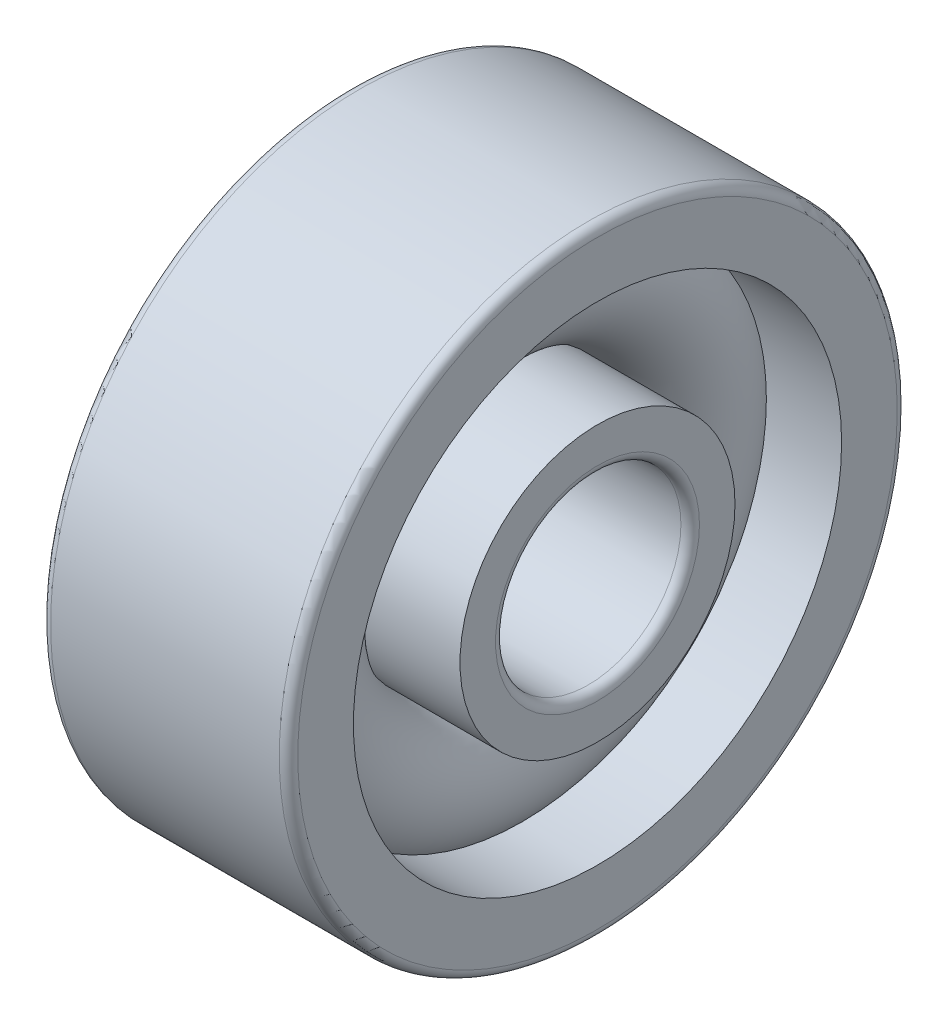
ISO-10303-21;
HEADER;
FILE_DESCRIPTION(('STEP AP214'),'2;1');
FILE_NAME('part.step','',(''),(''),'','','');
FILE_SCHEMA(('AUTOMOTIVE_DESIGN { 1 0 10303 214 1 1 1 1 }'));
ENDSEC;
DATA;
#1=APPLICATION_CONTEXT('core data for automotive mechanical design processes');
#2=APPLICATION_PROTOCOL_DEFINITION('international standard','automotive_design',2000,#1);
#3=PRODUCT_CONTEXT('',#1,'mechanical');
#4=PRODUCT('Part','Part','',(#3));
#5=PRODUCT_RELATED_PRODUCT_CATEGORY('part','',(#4));
#6=PRODUCT_DEFINITION_FORMATION('','',#4);
#7=PRODUCT_DEFINITION_CONTEXT('part definition',#1,'design');
#8=PRODUCT_DEFINITION('design','',#6,#7);
#9=PRODUCT_DEFINITION_SHAPE('','',#8);
#10=(LENGTH_UNIT() NAMED_UNIT(*) SI_UNIT(.MILLI.,.METRE.));
#11=(NAMED_UNIT(*) PLANE_ANGLE_UNIT() SI_UNIT($,.RADIAN.));
#12=(NAMED_UNIT(*) SI_UNIT($,.STERADIAN.) SOLID_ANGLE_UNIT());
#13=UNCERTAINTY_MEASURE_WITH_UNIT(LENGTH_MEASURE(1.E-05),#10,'distance_accuracy_value','');
#14=(GEOMETRIC_REPRESENTATION_CONTEXT(3) GLOBAL_UNCERTAINTY_ASSIGNED_CONTEXT((#13)) GLOBAL_UNIT_ASSIGNED_CONTEXT((#10,
#11,#12)) REPRESENTATION_CONTEXT('',''));
#15=CARTESIAN_POINT('',(0.,0.,0.));
#16=DIRECTION('',(0.,0.,1.));
#17=DIRECTION('',(1.,0.,0.));
#18=AXIS2_PLACEMENT_3D('',#15,#16,#17);
#19=CARTESIAN_POINT('',(0.,0.,0.));
#20=DIRECTION('',(-1.,0.,0.));
#21=DIRECTION('',(0.,0.,1.));
#22=AXIS2_PLACEMENT_3D('',#19,#20,#21);
#23=TOROIDAL_SURFACE('',#22,3.25,1.05);
#24=CARTESIAN_POINT('',(0.782623792124926,0.,0.));
#25=DIRECTION('',(-1.,0.,0.));
#26=DIRECTION('',(0.,0.,1.));
#27=AXIS2_PLACEMENT_3D('',#24,#25,#26);
#28=CIRCLE('',#27,3.95);
#29=CARTESIAN_POINT('',(0.782623792124926,0.,3.95));
#30=VERTEX_POINT('',#29);
#31=EDGE_CURVE('E45',#30,#30,#28,.F.);
#32=ORIENTED_EDGE('',*,*,#31,.T.);
#33=EDGE_LOOP('',(#32));
#34=FACE_BOUND('',#33,.T.);
#35=CARTESIAN_POINT('',(0.227760839478607,0.,0.));
#36=DIRECTION('',(-1.,0.,0.));
#37=DIRECTION('',(0.,0.,1.));
#38=AXIS2_PLACEMENT_3D('',#35,#36,#37);
#39=CIRCLE('',#38,2.225);
#40=CARTESIAN_POINT('',(0.227760839478607,0.,2.225));
#41=VERTEX_POINT('',#40);
#42=EDGE_CURVE('E10',#41,#41,#39,.T.);
#43=ORIENTED_EDGE('',*,*,#42,.T.);
#44=EDGE_LOOP('',(#43));
#45=FACE_BOUND('',#44,.T.);
#46=ADVANCED_FACE('F41',(#34,#45),#23,.T.);
#47=CARTESIAN_POINT('',(-20.6375,0.,0.));
#48=DIRECTION('',(1.,0.,0.));
#49=DIRECTION('',(0.,0.,-1.));
#50=AXIS2_PLACEMENT_3D('',#47,#48,#49);
#51=CYLINDRICAL_SURFACE('',#50,2.225);
#52=CARTESIAN_POINT('',(2.,0.,0.));
#53=DIRECTION('',(1.,0.,0.));
#54=DIRECTION('',(0.,0.,-1.));
#55=AXIS2_PLACEMENT_3D('',#52,#53,#54);
#56=CIRCLE('',#55,2.225);
#57=CARTESIAN_POINT('',(2.,0.,-2.225));
#58=VERTEX_POINT('',#57);
#59=EDGE_CURVE('E56',#58,#58,#56,.T.);
#60=ORIENTED_EDGE('',*,*,#59,.F.);
#61=EDGE_LOOP('',(#60));
#62=FACE_BOUND('',#61,.T.);
#63=ORIENTED_EDGE('',*,*,#42,.F.);
#64=EDGE_LOOP('',(#63));
#65=FACE_BOUND('',#64,.T.);
#66=ADVANCED_FACE('F105',(#62,#65),#51,.T.);
#67=CARTESIAN_POINT('',(-20.6375,0.,0.));
#68=DIRECTION('',(1.,0.,0.));
#69=DIRECTION('',(0.,0.,-1.));
#70=AXIS2_PLACEMENT_3D('',#67,#68,#69);
#71=CYLINDRICAL_SURFACE('',#70,2.55);
#72=CARTESIAN_POINT('',(-2.,0.,0.));
#73=DIRECTION('',(1.,0.,0.));
#74=DIRECTION('',(0.,0.,-1.));
#75=AXIS2_PLACEMENT_3D('',#72,#73,#74);
#76=CIRCLE('',#75,2.55);
#77=CARTESIAN_POINT('',(-2.,0.,-2.55));
#78=VERTEX_POINT('',#77);
#79=EDGE_CURVE('E68',#78,#78,#76,.T.);
#80=ORIENTED_EDGE('',*,*,#79,.T.);
#81=EDGE_LOOP('',(#80));
#82=FACE_BOUND('',#81,.T.);
#83=CARTESIAN_POINT('',(-0.782623792124926,0.,0.));
#84=DIRECTION('',(1.,0.,0.));
#85=DIRECTION('',(0.,0.,-1.));
#86=AXIS2_PLACEMENT_3D('',#83,#84,#85);
#87=CIRCLE('',#86,2.55);
#88=CARTESIAN_POINT('',(-0.782623792124926,0.,-2.55));
#89=VERTEX_POINT('',#88);
#90=EDGE_CURVE('E50',#89,#89,#87,.T.);
#91=ORIENTED_EDGE('',*,*,#90,.F.);
#92=EDGE_LOOP('',(#91));
#93=FACE_BOUND('',#92,.T.);
#94=ADVANCED_FACE('F108',(#82,#93),#71,.T.);
#95=CARTESIAN_POINT('',(2.,1.65,0.));
#96=DIRECTION('',(1.,0.,0.));
#97=DIRECTION('',(0.,0.,-1.));
#98=AXIS2_PLACEMENT_3D('',#95,#96,#97);
#99=PLANE('',#98);
#100=ORIENTED_EDGE('',*,*,#59,.T.);
#101=EDGE_LOOP('',(#100));
#102=FACE_BOUND('',#101,.T.);
#103=CARTESIAN_POINT('',(2.,0.,0.));
#104=DIRECTION('',(1.,0.,0.));
#105=DIRECTION('',(0.,0.,-1.));
#106=AXIS2_PLACEMENT_3D('',#103,#104,#105);
#107=CIRCLE('',#106,1.65);
#108=CARTESIAN_POINT('',(2.,0.,-1.65));
#109=VERTEX_POINT('',#108);
#110=EDGE_CURVE('E95',#109,#109,#107,.T.);
#111=ORIENTED_EDGE('',*,*,#110,.F.);
#112=EDGE_LOOP('',(#111));
#113=FACE_BOUND('',#112,.T.);
#114=ADVANCED_FACE('F102',(#102,#113),#99,.T.);
#115=CARTESIAN_POINT('',(1.85,0.,0.));
#116=DIRECTION('',(1.,0.,0.));
#117=DIRECTION('',(0.,0.,-1.));
#118=AXIS2_PLACEMENT_3D('',#115,#116,#117);
#119=TOROIDAL_SURFACE('',#118,1.65,0.15);
#120=ORIENTED_EDGE('',*,*,#110,.T.);
#121=EDGE_LOOP('',(#120));
#122=FACE_BOUND('',#121,.T.);
#123=CARTESIAN_POINT('',(1.85,0.,0.));
#124=DIRECTION('',(1.,0.,0.));
#125=DIRECTION('',(0.,0.,-1.));
#126=AXIS2_PLACEMENT_3D('',#123,#124,#125);
#127=CIRCLE('',#126,1.5);
#128=CARTESIAN_POINT('',(1.85,0.,-1.5));
#129=VERTEX_POINT('',#128);
#130=EDGE_CURVE('E91',#129,#129,#127,.T.);
#131=ORIENTED_EDGE('',*,*,#130,.F.);
#132=EDGE_LOOP('',(#131));
#133=FACE_BOUND('',#132,.T.);
#134=ADVANCED_FACE('F119',(#122,#133),#119,.T.);
#135=CARTESIAN_POINT('',(-20.6375,0.,0.));
#136=DIRECTION('',(1.,0.,0.));
#137=DIRECTION('',(0.,0.,-1.));
#138=AXIS2_PLACEMENT_3D('',#135,#136,#137);
#139=CYLINDRICAL_SURFACE('',#138,1.5);
#140=ORIENTED_EDGE('',*,*,#130,.T.);
#141=EDGE_LOOP('',(#140));
#142=FACE_BOUND('',#141,.T.);
#143=CARTESIAN_POINT('',(-1.85,0.,0.));
#144=DIRECTION('',(1.,0.,0.));
#145=DIRECTION('',(0.,0.,-1.));
#146=AXIS2_PLACEMENT_3D('',#143,#144,#145);
#147=CIRCLE('',#146,1.5);
#148=CARTESIAN_POINT('',(-1.85,0.,-1.5));
#149=VERTEX_POINT('',#148);
#150=EDGE_CURVE('E87',#149,#149,#147,.T.);
#151=ORIENTED_EDGE('',*,*,#150,.F.);
#152=EDGE_LOOP('',(#151));
#153=FACE_BOUND('',#152,.T.);
#154=ADVANCED_FACE('F122',(#142,#153),#139,.F.);
#155=CARTESIAN_POINT('',(-1.85,0.,0.));
#156=DIRECTION('',(1.,0.,0.));
#157=DIRECTION('',(0.,0.,-1.));
#158=AXIS2_PLACEMENT_3D('',#155,#156,#157);
#159=TOROIDAL_SURFACE('',#158,1.65,0.15);
#160=ORIENTED_EDGE('',*,*,#150,.T.);
#161=EDGE_LOOP('',(#160));
#162=FACE_BOUND('',#161,.T.);
#163=CARTESIAN_POINT('',(-2.,0.,0.));
#164=DIRECTION('',(1.,0.,0.));
#165=DIRECTION('',(0.,0.,-1.));
#166=AXIS2_PLACEMENT_3D('',#163,#164,#165);
#167=CIRCLE('',#166,1.65);
#168=CARTESIAN_POINT('',(-2.,0.,-1.65));
#169=VERTEX_POINT('',#168);
#170=EDGE_CURVE('E83',#169,#169,#167,.T.);
#171=ORIENTED_EDGE('',*,*,#170,.F.);
#172=EDGE_LOOP('',(#171));
#173=FACE_BOUND('',#172,.T.);
#174=ADVANCED_FACE('F126',(#162,#173),#159,.T.);
#175=CARTESIAN_POINT('',(-2.,2.55,0.));
#176=DIRECTION('',(-1.,0.,0.));
#177=DIRECTION('',(0.,0.,1.));
#178=AXIS2_PLACEMENT_3D('',#175,#176,#177);
#179=PLANE('',#178);
#180=ORIENTED_EDGE('',*,*,#170,.T.);
#181=EDGE_LOOP('',(#180));
#182=FACE_BOUND('',#181,.T.);
#183=ORIENTED_EDGE('',*,*,#79,.F.);
#184=EDGE_LOOP('',(#183));
#185=FACE_BOUND('',#184,.T.);
#186=ADVANCED_FACE('F130',(#182,#185),#179,.T.);
#187=CARTESIAN_POINT('',(-0.227760839478607,0.,0.));
#188=DIRECTION('',(1.,0.,0.));
#189=DIRECTION('',(0.,0.,-1.));
#190=AXIS2_PLACEMENT_3D('',#187,#188,#189);
#191=CIRCLE('',#190,4.275);
#192=CARTESIAN_POINT('',(-0.227760839478607,0.,-4.275));
#193=VERTEX_POINT('',#192);
#194=EDGE_CURVE('E59',#193,#193,#191,.F.);
#195=ORIENTED_EDGE('',*,*,#194,.T.);
#196=EDGE_LOOP('',(#195));
#197=FACE_BOUND('',#196,.T.);
#198=ORIENTED_EDGE('',*,*,#90,.T.);
#199=EDGE_LOOP('',(#198));
#200=FACE_BOUND('',#199,.T.);
#201=ADVANCED_FACE('F43',(#197,#200),#23,.T.);
#202=CARTESIAN_POINT('',(-20.6375,0.,0.));
#203=DIRECTION('',(1.,0.,0.));
#204=DIRECTION('',(0.,0.,-1.));
#205=AXIS2_PLACEMENT_3D('',#202,#203,#204);
#206=CYLINDRICAL_SURFACE('',#205,3.95);
#207=CARTESIAN_POINT('',(2.,0.,0.));
#208=DIRECTION('',(1.,0.,0.));
#209=DIRECTION('',(0.,0.,-1.));
#210=AXIS2_PLACEMENT_3D('',#207,#208,#209);
#211=CIRCLE('',#210,3.95);
#212=CARTESIAN_POINT('',(2.,0.,-3.95));
#213=VERTEX_POINT('',#212);
#214=EDGE_CURVE('E173',#213,#213,#211,.T.);
#215=ORIENTED_EDGE('',*,*,#214,.T.);
#216=EDGE_LOOP('',(#215));
#217=FACE_BOUND('',#216,.T.);
#218=ORIENTED_EDGE('',*,*,#31,.F.);
#219=EDGE_LOOP('',(#218));
#220=FACE_BOUND('',#219,.T.);
#221=ADVANCED_FACE('F152',(#217,#220),#206,.F.);
#222=CARTESIAN_POINT('',(-20.6375,0.,0.));
#223=DIRECTION('',(1.,0.,0.));
#224=DIRECTION('',(0.,0.,-1.));
#225=AXIS2_PLACEMENT_3D('',#222,#223,#224);
#226=CYLINDRICAL_SURFACE('',#225,4.275);
#227=CARTESIAN_POINT('',(-2.,0.,0.));
#228=DIRECTION('',(1.,0.,0.));
#229=DIRECTION('',(0.,0.,-1.));
#230=AXIS2_PLACEMENT_3D('',#227,#228,#229);
#231=CIRCLE('',#230,4.275);
#232=CARTESIAN_POINT('',(-2.,0.,-4.275));
#233=VERTEX_POINT('',#232);
#234=EDGE_CURVE('E166',#233,#233,#231,.T.);
#235=ORIENTED_EDGE('',*,*,#234,.F.);
#236=EDGE_LOOP('',(#235));
#237=FACE_BOUND('',#236,.T.);
#238=ORIENTED_EDGE('',*,*,#194,.F.);
#239=EDGE_LOOP('',(#238));
#240=FACE_BOUND('',#239,.T.);
#241=ADVANCED_FACE('F139',(#237,#240),#226,.F.);
#242=CARTESIAN_POINT('',(-1.85,0.,0.));
#243=DIRECTION('',(1.,0.,0.));
#244=DIRECTION('',(0.,0.,-1.));
#245=AXIS2_PLACEMENT_3D('',#242,#243,#244);
#246=TOROIDAL_SURFACE('',#245,4.85,0.15);
#247=CARTESIAN_POINT('',(-2.,0.,0.));
#248=DIRECTION('',(1.,0.,0.));
#249=DIRECTION('',(0.,0.,-1.));
#250=AXIS2_PLACEMENT_3D('',#247,#248,#249);
#251=CIRCLE('',#250,4.85);
#252=CARTESIAN_POINT('',(-2.,0.,-4.85));
#253=VERTEX_POINT('',#252);
#254=EDGE_CURVE('E169',#253,#253,#251,.T.);
#255=ORIENTED_EDGE('',*,*,#254,.T.);
#256=EDGE_LOOP('',(#255));
#257=FACE_BOUND('',#256,.T.);
#258=CARTESIAN_POINT('',(-1.85,0.,0.));
#259=DIRECTION('',(1.,0.,0.));
#260=DIRECTION('',(0.,0.,-1.));
#261=AXIS2_PLACEMENT_3D('',#258,#259,#260);
#262=CIRCLE('',#261,5.);
#263=CARTESIAN_POINT('',(-1.85,0.,-5.));
#264=VERTEX_POINT('',#263);
#265=EDGE_CURVE('E62',#264,#264,#262,.T.);
#266=ORIENTED_EDGE('',*,*,#265,.F.);
#267=EDGE_LOOP('',(#266));
#268=FACE_BOUND('',#267,.T.);
#269=ADVANCED_FACE('F135',(#257,#268),#246,.T.);
#270=CARTESIAN_POINT('',(-20.6375,0.,0.));
#271=DIRECTION('',(1.,0.,0.));
#272=DIRECTION('',(0.,0.,-1.));
#273=AXIS2_PLACEMENT_3D('',#270,#271,#272);
#274=CYLINDRICAL_SURFACE('',#273,5.);
#275=ORIENTED_EDGE('',*,*,#265,.T.);
#276=EDGE_LOOP('',(#275));
#277=FACE_BOUND('',#276,.T.);
#278=CARTESIAN_POINT('',(1.85,0.,0.));
#279=DIRECTION('',(1.,0.,0.));
#280=DIRECTION('',(0.,0.,-1.));
#281=AXIS2_PLACEMENT_3D('',#278,#279,#280);
#282=CIRCLE('',#281,5.);
#283=CARTESIAN_POINT('',(1.85,0.,-5.));
#284=VERTEX_POINT('',#283);
#285=EDGE_CURVE('E70',#284,#284,#282,.T.);
#286=ORIENTED_EDGE('',*,*,#285,.F.);
#287=EDGE_LOOP('',(#286));
#288=FACE_BOUND('',#287,.T.);
#289=ADVANCED_FACE('F138',(#277,#288),#274,.T.);
#290=CARTESIAN_POINT('',(1.85,0.,0.));
#291=DIRECTION('',(1.,0.,0.));
#292=DIRECTION('',(0.,0.,-1.));
#293=AXIS2_PLACEMENT_3D('',#290,#291,#292);
#294=TOROIDAL_SURFACE('',#293,4.85,0.15);
#295=ORIENTED_EDGE('',*,*,#285,.T.);
#296=EDGE_LOOP('',(#295));
#297=FACE_BOUND('',#296,.T.);
#298=CARTESIAN_POINT('',(2.,0.,0.));
#299=DIRECTION('',(1.,0.,0.));
#300=DIRECTION('',(0.,0.,-1.));
#301=AXIS2_PLACEMENT_3D('',#298,#299,#300);
#302=CIRCLE('',#301,4.85);
#303=CARTESIAN_POINT('',(2.,0.,-4.85));
#304=VERTEX_POINT('',#303);
#305=EDGE_CURVE('E76',#304,#304,#302,.T.);
#306=ORIENTED_EDGE('',*,*,#305,.F.);
#307=EDGE_LOOP('',(#306));
#308=FACE_BOUND('',#307,.T.);
#309=ADVANCED_FACE('F143',(#297,#308),#294,.T.);
#310=CARTESIAN_POINT('',(2.,4.85,0.));
#311=DIRECTION('',(1.,0.,0.));
#312=DIRECTION('',(0.,0.,-1.));
#313=AXIS2_PLACEMENT_3D('',#310,#311,#312);
#314=PLANE('',#313);
#315=ORIENTED_EDGE('',*,*,#305,.T.);
#316=EDGE_LOOP('',(#315));
#317=FACE_BOUND('',#316,.T.);
#318=ORIENTED_EDGE('',*,*,#214,.F.);
#319=EDGE_LOOP('',(#318));
#320=FACE_BOUND('',#319,.T.);
#321=ADVANCED_FACE('F146',(#317,#320),#314,.T.);
#322=CARTESIAN_POINT('',(-2.,4.275,0.));
#323=DIRECTION('',(-1.,0.,0.));
#324=DIRECTION('',(0.,0.,1.));
#325=AXIS2_PLACEMENT_3D('',#322,#323,#324);
#326=PLANE('',#325);
#327=ORIENTED_EDGE('',*,*,#234,.T.);
#328=EDGE_LOOP('',(#327));
#329=FACE_BOUND('',#328,.T.);
#330=ORIENTED_EDGE('',*,*,#254,.F.);
#331=EDGE_LOOP('',(#330));
#332=FACE_BOUND('',#331,.T.);
#333=ADVANCED_FACE('F150',(#329,#332),#326,.T.);
#334=CLOSED_SHELL('',(#46,#66,#94,#114,#134,#154,#174,#186,#201,#221,#241,#269,#289,#309,#321,#333));
#335=MANIFOLD_SOLID_BREP('B2',#334);
#336=ADVANCED_BREP_SHAPE_REPRESENTATION('',(#18,#335),#14);
#337=SHAPE_DEFINITION_REPRESENTATION(#9,#336);
ENDSEC;
END-ISO-10303-21;
